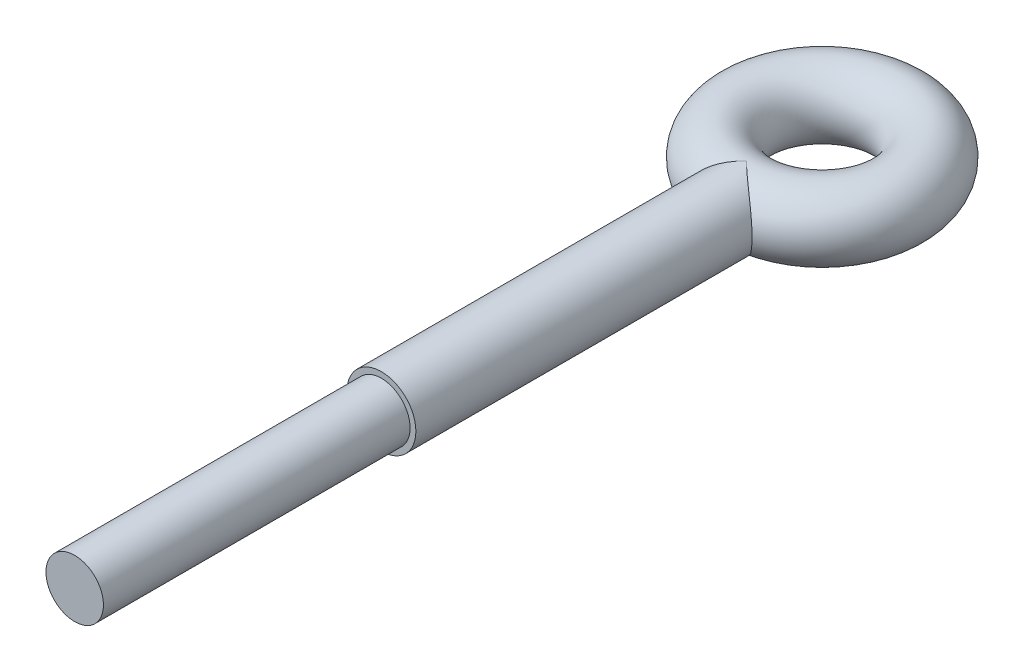
ISO-10303-21;
HEADER;
FILE_DESCRIPTION(('STEP AP214'),'2;1');
FILE_NAME('part.step','',(''),(''),'','','');
FILE_SCHEMA(('AUTOMOTIVE_DESIGN { 1 0 10303 214 1 1 1 1 }'));
ENDSEC;
DATA;
#1=APPLICATION_CONTEXT('core data for automotive mechanical design processes');
#2=APPLICATION_PROTOCOL_DEFINITION('international standard','automotive_design',2000,#1);
#3=PRODUCT_CONTEXT('',#1,'mechanical');
#4=PRODUCT('Part','Part','',(#3));
#5=PRODUCT_RELATED_PRODUCT_CATEGORY('part','',(#4));
#6=PRODUCT_DEFINITION_FORMATION('','',#4);
#7=PRODUCT_DEFINITION_CONTEXT('part definition',#1,'design');
#8=PRODUCT_DEFINITION('design','',#6,#7);
#9=PRODUCT_DEFINITION_SHAPE('','',#8);
#10=(LENGTH_UNIT() NAMED_UNIT(*) SI_UNIT(.MILLI.,.METRE.));
#11=(NAMED_UNIT(*) PLANE_ANGLE_UNIT() SI_UNIT($,.RADIAN.));
#12=(NAMED_UNIT(*) SI_UNIT($,.STERADIAN.) SOLID_ANGLE_UNIT());
#13=UNCERTAINTY_MEASURE_WITH_UNIT(LENGTH_MEASURE(1.E-05),#10,'distance_accuracy_value','');
#14=(GEOMETRIC_REPRESENTATION_CONTEXT(3) GLOBAL_UNCERTAINTY_ASSIGNED_CONTEXT((#13)) GLOBAL_UNIT_ASSIGNED_CONTEXT((#10,
#11,#12)) REPRESENTATION_CONTEXT('',''));
#15=CARTESIAN_POINT('',(0.,0.,0.));
#16=DIRECTION('',(0.,0.,1.));
#17=DIRECTION('',(1.,0.,0.));
#18=AXIS2_PLACEMENT_3D('',#15,#16,#17);
#19=CARTESIAN_POINT('',(0.,0.,0.));
#20=DIRECTION('',(0.,1.,0.));
#21=DIRECTION('',(0.,0.,1.));
#22=AXIS2_PLACEMENT_3D('',#19,#20,#21);
#23=TOROIDAL_SURFACE('',#22,3.95,1.8);
#24=CARTESIAN_POINT('',(0.,1.8,3.95));
#25=CARTESIAN_POINT('',(-0.00199994140846303,1.80000000075811,3.95199994947279));
#26=CARTESIAN_POINT('',(-0.00400070372002434,1.79999666755845,3.95399919257261));
#27=CARTESIAN_POINT('',(-0.113468813036606,1.7996315951971,4.06330091222263));
#28=CARTESIAN_POINT('',(-0.223272436129086,1.78963918766644,4.1685503749568));
#29=CARTESIAN_POINT('',(-0.444577564780809,1.74787073001142,4.37323105751555));
#30=CARTESIAN_POINT('',(-0.556081491505054,1.71606008324548,4.47265276423786));
#31=CARTESIAN_POINT('',(-0.75928622185364,1.63508233435012,4.64836858333206));
#32=CARTESIAN_POINT('',(-0.851347844790862,1.5894239560127,4.72584318305131));
#33=CARTESIAN_POINT('',(-1.03037147401365,1.47963656706274,4.8731757920402));
#34=CARTESIAN_POINT('',(-1.1173416012696,1.41553799130346,4.94304609213481));
#35=CARTESIAN_POINT('',(-1.26675660870547,1.28196001585496,5.0608977423174));
#36=CARTESIAN_POINT('',(-1.33075645057861,1.2156912033067,5.11053429492222));
#37=CARTESIAN_POINT('',(-1.44993593286509,1.07073611284643,5.20183399086526));
#38=CARTESIAN_POINT('',(-1.50511669246779,0.992051413100501,5.24349814607653));
#39=CARTESIAN_POINT('',(-1.60401746206353,0.82268971859404,5.31748286137033));
#40=CARTESIAN_POINT('',(-1.6476370424261,0.731917311673139,5.34972177994847));
#41=CARTESIAN_POINT('',(-1.71965999982079,0.541389682450782,5.40264043706118));
#42=CARTESIAN_POINT('',(-1.74807987107102,0.44164433521107,5.42333270669667));
#43=CARTESIAN_POINT('',(-1.7845004278889,0.2519709291558,5.44978892195935));
#44=CARTESIAN_POINT('',(-1.79487679190532,0.162736156709184,5.45729152831868));
#45=CARTESIAN_POINT('',(-1.80215390863839,-0.0165508132680034,5.46255668791868));
#46=CARTESIAN_POINT('',(-1.79906179921967,-0.106602552584922,5.46032440034427));
#47=CARTESIAN_POINT('',(-1.78042606998608,-0.277216694184294,5.44682506445706));
#48=CARTESIAN_POINT('',(-1.76591450652981,-0.357955639439882,5.43630679685068));
#49=CARTESIAN_POINT('',(-1.72653522708136,-0.515425639486962,5.4076180369073));
#50=CARTESIAN_POINT('',(-1.70166719286759,-0.592156571043329,5.38944730943421));
#51=CARTESIAN_POINT('',(-1.64183287066045,-0.742390034793744,5.34541651611072));
#52=CARTESIAN_POINT('',(-1.60655589213492,-0.815697999289701,5.31931901375054));
#53=CARTESIAN_POINT('',(-1.52790204292004,-0.954944104211239,5.26058813967687));
#54=CARTESIAN_POINT('',(-1.48452263041547,-1.02087992151487,5.22795271671806));
#55=CARTESIAN_POINT('',(-1.38559380209553,-1.1522564906908,5.15269550990384));
#56=CARTESIAN_POINT('',(-1.32920390983229,-1.21664043891793,5.10933933657652));
#57=CARTESIAN_POINT('',(-1.21049915533664,-1.33481176779664,5.01673139390679));
#58=CARTESIAN_POINT('',(-1.14817960537539,-1.38859065961643,4.96747495196942));
#59=CARTESIAN_POINT('',(-0.989683489612356,-1.50811954680728,4.84011377079281));
#60=CARTESIAN_POINT('',(-0.891201585563278,-1.56786607162224,4.75921911299649));
#61=CARTESIAN_POINT('',(-0.690461915061808,-1.66606971483105,4.58959275417006));
#62=CARTESIAN_POINT('',(-0.588198889741747,-1.70449589376651,4.50084987927359));
#63=CARTESIAN_POINT('',(-0.40505396058336,-1.75584277815748,4.33678306280864));
#64=CARTESIAN_POINT('',(-0.324180490052973,-1.77242009527419,4.26254216901044));
#65=CARTESIAN_POINT('',(-0.163801512680322,-1.79435346055348,4.11123330459566));
#66=CARTESIAN_POINT('',(-0.0842938822745436,-1.79972886197202,4.03417044427587));
#67=CARTESIAN_POINT('',(-0.00400071967891463,-1.79999666828832,3.95399920554553));
#68=CARTESIAN_POINT('',(-0.00199995740598304,-1.80000000155696,3.95199996242846));
#69=CARTESIAN_POINT('',(0.,-1.8,3.95));
#70=B_SPLINE_CURVE_WITH_KNOTS('',3,(#24,#25,#26,#27,#28,#29,#30,#31,#32,#33,#34,#35,#36,#37,#38,
#39,#40,#41,#42,#43,#44,#45,#46,#47,#48,#49,#50,#51,#52,#53,#54,#55,#56,#57,#58,#59,#60,#61,#62,
#63,#64,#65,#66,#67,#68,#69),.UNSPECIFIED.,.F.,.F.,(4,2,2,2,2,2,2,2,2,2,2,2,2,2,2,2,2,2,2,2,2,2,
4),(0.,0.00848528788666754,0.464069213075239,0.92037722163025,1.30505055207295,1.68909260066875,
2.00180539112789,2.31447846507244,2.62978470058272,2.94474807842985,3.21371964845068,
3.48254868940124,3.72953623438895,3.97653136908265,4.23180983980834,4.48716852887962,
4.77391138923688,5.06088284985502,5.48085525452539,5.90143552734349,6.23391543095628,
6.56582043992089,6.57430572780919),.UNSPECIFIED.);
#71=CARTESIAN_POINT('',(0.,-1.80000000000003,3.95));
#72=VERTEX_POINT('',#71);
#73=CARTESIAN_POINT('',(0.,1.8,3.95));
#74=VERTEX_POINT('',#73);
#75=EDGE_CURVE('E47',#72,#74,#70,.F.);
#76=ORIENTED_EDGE('',*,*,#75,.T.);
#77=CARTESIAN_POINT('',(0.,1.8,3.95));
#78=CARTESIAN_POINT('',(0.00199994140846303,1.80000000075811,3.95199994947279));
#79=CARTESIAN_POINT('',(0.00400070372002434,1.79999666755845,3.95399919257261));
#80=CARTESIAN_POINT('',(0.113468813036606,1.7996315951971,4.06330091222263));
#81=CARTESIAN_POINT('',(0.223272436129086,1.78963918766644,4.1685503749568));
#82=CARTESIAN_POINT('',(0.444577564780809,1.74787073001142,4.37323105751555));
#83=CARTESIAN_POINT('',(0.556081491505054,1.71606008324548,4.47265276423786));
#84=CARTESIAN_POINT('',(0.75928622185364,1.63508233435012,4.64836858333206));
#85=CARTESIAN_POINT('',(0.851347844790862,1.5894239560127,4.72584318305131));
#86=CARTESIAN_POINT('',(1.03037147401365,1.47963656706274,4.8731757920402));
#87=CARTESIAN_POINT('',(1.1173416012696,1.41553799130346,4.94304609213481));
#88=CARTESIAN_POINT('',(1.26675660870547,1.28196001585496,5.0608977423174));
#89=CARTESIAN_POINT('',(1.33075645057861,1.2156912033067,5.11053429492222));
#90=CARTESIAN_POINT('',(1.44993593286509,1.07073611284643,5.20183399086526));
#91=CARTESIAN_POINT('',(1.50511669246779,0.992051413100501,5.24349814607653));
#92=CARTESIAN_POINT('',(1.60401746206353,0.82268971859404,5.31748286137033));
#93=CARTESIAN_POINT('',(1.6476370424261,0.731917311673139,5.34972177994847));
#94=CARTESIAN_POINT('',(1.71965999982079,0.541389682450782,5.40264043706118));
#95=CARTESIAN_POINT('',(1.74807987107102,0.44164433521107,5.42333270669667));
#96=CARTESIAN_POINT('',(1.7845004278889,0.2519709291558,5.44978892195935));
#97=CARTESIAN_POINT('',(1.79487679190532,0.162736156709184,5.45729152831868));
#98=CARTESIAN_POINT('',(1.80215390863839,-0.0165508132680034,5.46255668791868));
#99=CARTESIAN_POINT('',(1.79906179921967,-0.106602552584922,5.46032440034427));
#100=CARTESIAN_POINT('',(1.78042606998608,-0.277216694184294,5.44682506445706));
#101=CARTESIAN_POINT('',(1.76591450652981,-0.357955639439882,5.43630679685068));
#102=CARTESIAN_POINT('',(1.72653522708136,-0.515425639486962,5.4076180369073));
#103=CARTESIAN_POINT('',(1.70166719286759,-0.592156571043329,5.38944730943421));
#104=CARTESIAN_POINT('',(1.64183287066045,-0.742390034793744,5.34541651611072));
#105=CARTESIAN_POINT('',(1.60655589213492,-0.815697999289701,5.31931901375054));
#106=CARTESIAN_POINT('',(1.52790204292004,-0.954944104211239,5.26058813967687));
#107=CARTESIAN_POINT('',(1.48452263041547,-1.02087992151487,5.22795271671806));
#108=CARTESIAN_POINT('',(1.38559380209553,-1.1522564906908,5.15269550990384));
#109=CARTESIAN_POINT('',(1.32920390983229,-1.21664043891793,5.10933933657652));
#110=CARTESIAN_POINT('',(1.21049915533664,-1.33481176779664,5.01673139390679));
#111=CARTESIAN_POINT('',(1.14817960537539,-1.38859065961643,4.96747495196942));
#112=CARTESIAN_POINT('',(0.989683489612356,-1.50811954680728,4.84011377079281));
#113=CARTESIAN_POINT('',(0.891201585563278,-1.56786607162224,4.75921911299649));
#114=CARTESIAN_POINT('',(0.690461915061808,-1.66606971483105,4.58959275417006));
#115=CARTESIAN_POINT('',(0.588198889741747,-1.70449589376651,4.50084987927359));
#116=CARTESIAN_POINT('',(0.40505396058336,-1.75584277815748,4.33678306280864));
#117=CARTESIAN_POINT('',(0.324180490052973,-1.77242009527419,4.26254216901044));
#118=CARTESIAN_POINT('',(0.163801512680322,-1.79435346055348,4.11123330459566));
#119=CARTESIAN_POINT('',(0.0842938822745436,-1.79972886197202,4.03417044427587));
#120=CARTESIAN_POINT('',(0.00400071967891463,-1.79999666828832,3.95399920554553));
#121=CARTESIAN_POINT('',(0.00199995740598304,-1.80000000155696,3.95199996242846));
#122=CARTESIAN_POINT('',(0.,-1.8,3.95));
#123=B_SPLINE_CURVE_WITH_KNOTS('',3,(#77,#78,#79,#80,#81,#82,#83,#84,#85,#86,#87,#88,#89,#90,
#91,#92,#93,#94,#95,#96,#97,#98,#99,#100,#101,#102,#103,#104,#105,#106,#107,#108,#109,#110,#111,
#112,#113,#114,#115,#116,#117,#118,#119,#120,#121,#122),.UNSPECIFIED.,.F.,.F.,(4,2,2,2,2,2,2,2,
2,2,2,2,2,2,2,2,2,2,2,2,2,2,4),(0.,0.00848528788666754,0.464069213075239,0.92037722163025,
1.30505055207295,1.68909260066875,2.00180539112789,2.31447846507244,2.62978470058272,
2.94474807842985,3.21371964845068,3.48254868940124,3.72953623438895,3.97653136908265,
4.23180983980834,4.48716852887962,4.77391138923688,5.06088284985502,5.48085525452539,
5.90143552734349,6.23391543095628,6.56582043992089,6.57430572780919),.UNSPECIFIED.);
#124=EDGE_CURVE('E37',#74,#72,#123,.T.);
#125=ORIENTED_EDGE('',*,*,#124,.T.);
#126=EDGE_LOOP('',(#76,#125));
#127=FACE_BOUND('',#126,.T.);
#128=ADVANCED_FACE('F34',(#127),#23,.T.);
#129=CARTESIAN_POINT('',(0.,0.,23.));
#130=DIRECTION('',(0.,0.,1.));
#131=DIRECTION('',(1.,0.,0.));
#132=AXIS2_PLACEMENT_3D('',#129,#130,#131);
#133=PLANE('',#132);
#134=CARTESIAN_POINT('',(0.,0.,23.));
#135=DIRECTION('',(0.,0.,1.));
#136=DIRECTION('',(1.,0.,0.));
#137=AXIS2_PLACEMENT_3D('',#134,#135,#136);
#138=CIRCLE('',#137,1.5);
#139=CARTESIAN_POINT('',(1.5,0.,23.));
#140=VERTEX_POINT('',#139);
#141=EDGE_CURVE('E11',#140,#140,#138,.T.);
#142=ORIENTED_EDGE('',*,*,#141,.F.);
#143=EDGE_LOOP('',(#142));
#144=FACE_BOUND('',#143,.T.);
#145=CARTESIAN_POINT('',(0.,0.,23.));
#146=DIRECTION('',(0.,0.,1.));
#147=DIRECTION('',(1.,0.,0.));
#148=AXIS2_PLACEMENT_3D('',#145,#146,#147);
#149=CIRCLE('',#148,1.8);
#150=CARTESIAN_POINT('',(1.8,0.,23.));
#151=VERTEX_POINT('',#150);
#152=EDGE_CURVE('E58',#151,#151,#149,.T.);
#153=ORIENTED_EDGE('',*,*,#152,.T.);
#154=EDGE_LOOP('',(#153));
#155=FACE_BOUND('',#154,.T.);
#156=ADVANCED_FACE('F75',(#144,#155),#133,.T.);
#157=CARTESIAN_POINT('',(0.,0.,-5.751));
#158=DIRECTION('',(0.,0.,1.));
#159=DIRECTION('',(1.,0.,0.));
#160=AXIS2_PLACEMENT_3D('',#157,#158,#159);
#161=CYLINDRICAL_SURFACE('',#160,1.8);
#162=ORIENTED_EDGE('',*,*,#124,.F.);
#163=ORIENTED_EDGE('',*,*,#75,.F.);
#164=EDGE_LOOP('',(#162,#163));
#165=FACE_BOUND('',#164,.T.);
#166=ORIENTED_EDGE('',*,*,#152,.F.);
#167=EDGE_LOOP('',(#166));
#168=FACE_BOUND('',#167,.T.);
#169=ADVANCED_FACE('F56',(#165,#168),#161,.T.);
#170=CARTESIAN_POINT('',(0.,0.,39.));
#171=DIRECTION('',(0.,0.,-1.));
#172=DIRECTION('',(-1.,0.,0.));
#173=AXIS2_PLACEMENT_3D('',#170,#171,#172);
#174=CYLINDRICAL_SURFACE('',#173,1.5);
#175=CARTESIAN_POINT('',(0.,0.,39.));
#176=DIRECTION('',(0.,0.,1.));
#177=DIRECTION('',(1.,0.,0.));
#178=AXIS2_PLACEMENT_3D('',#175,#176,#177);
#179=CIRCLE('',#178,1.5);
#180=CARTESIAN_POINT('',(1.5,0.,39.));
#181=VERTEX_POINT('',#180);
#182=EDGE_CURVE('E60',#181,#181,#179,.T.);
#183=ORIENTED_EDGE('',*,*,#182,.F.);
#184=EDGE_LOOP('',(#183));
#185=FACE_BOUND('',#184,.T.);
#186=ORIENTED_EDGE('',*,*,#141,.T.);
#187=EDGE_LOOP('',(#186));
#188=FACE_BOUND('',#187,.T.);
#189=ADVANCED_FACE('F74',(#185,#188),#174,.T.);
#190=CARTESIAN_POINT('',(0.,0.,39.));
#191=DIRECTION('',(0.,0.,1.));
#192=DIRECTION('',(1.,0.,0.));
#193=AXIS2_PLACEMENT_3D('',#190,#191,#192);
#194=PLANE('',#193);
#195=ORIENTED_EDGE('',*,*,#182,.T.);
#196=EDGE_LOOP('',(#195));
#197=FACE_BOUND('',#196,.T.);
#198=ADVANCED_FACE('F82',(#197),#194,.T.);
#199=CLOSED_SHELL('',(#128,#156,#169,#189,#198));
#200=MANIFOLD_SOLID_BREP('B2',#199);
#201=ADVANCED_BREP_SHAPE_REPRESENTATION('',(#18,#200),#14);
#202=SHAPE_DEFINITION_REPRESENTATION(#9,#201);
ENDSEC;
END-ISO-10303-21;
